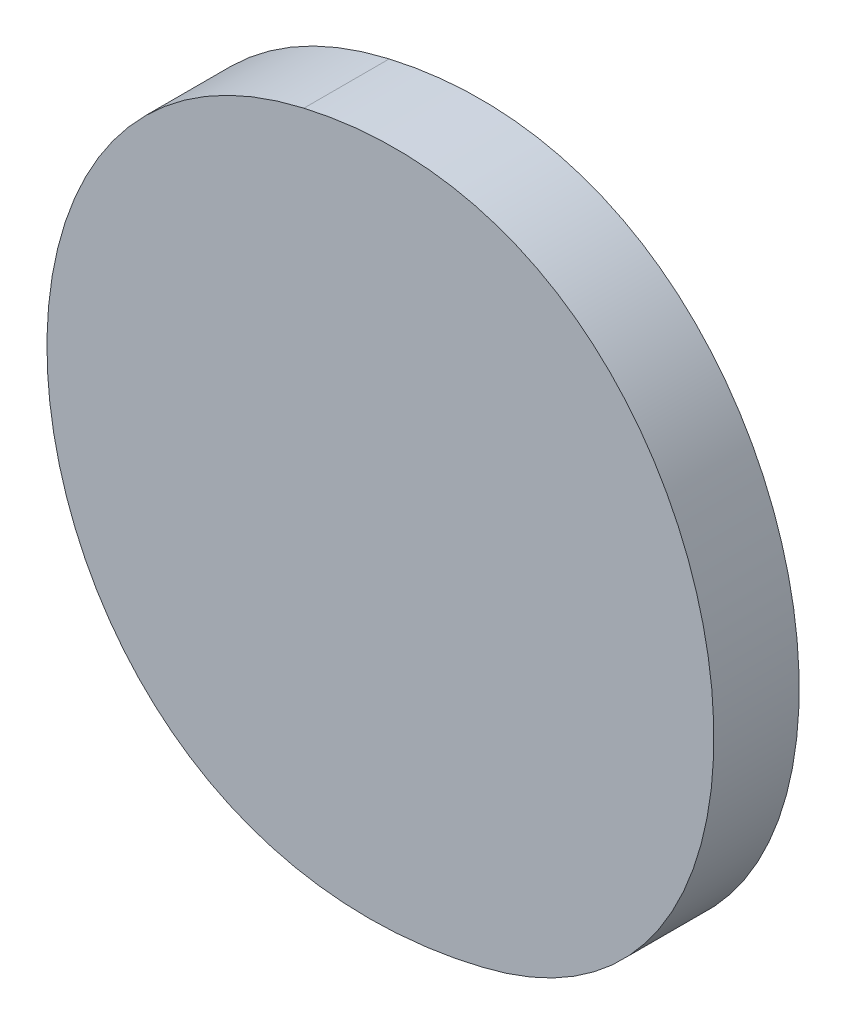
ISO-10303-21;
HEADER;
FILE_DESCRIPTION(('STEP AP214'),'2;1');
FILE_NAME('part.step','',(''),(''),'','','');
FILE_SCHEMA(('AUTOMOTIVE_DESIGN { 1 0 10303 214 1 1 1 1 }'));
ENDSEC;
DATA;
#1=APPLICATION_CONTEXT('core data for automotive mechanical design processes');
#2=APPLICATION_PROTOCOL_DEFINITION('international standard','automotive_design',2000,#1);
#3=PRODUCT_CONTEXT('',#1,'mechanical');
#4=PRODUCT('Part','Part','',(#3));
#5=PRODUCT_RELATED_PRODUCT_CATEGORY('part','',(#4));
#6=PRODUCT_DEFINITION_FORMATION('','',#4);
#7=PRODUCT_DEFINITION_CONTEXT('part definition',#1,'design');
#8=PRODUCT_DEFINITION('design','',#6,#7);
#9=PRODUCT_DEFINITION_SHAPE('','',#8);
#10=(LENGTH_UNIT() NAMED_UNIT(*) SI_UNIT(.MILLI.,.METRE.));
#11=(NAMED_UNIT(*) PLANE_ANGLE_UNIT() SI_UNIT($,.RADIAN.));
#12=(NAMED_UNIT(*) SI_UNIT($,.STERADIAN.) SOLID_ANGLE_UNIT());
#13=UNCERTAINTY_MEASURE_WITH_UNIT(LENGTH_MEASURE(1.E-05),#10,'distance_accuracy_value','');
#14=(GEOMETRIC_REPRESENTATION_CONTEXT(3) GLOBAL_UNCERTAINTY_ASSIGNED_CONTEXT((#13)) GLOBAL_UNIT_ASSIGNED_CONTEXT((#10,
#11,#12)) REPRESENTATION_CONTEXT('',''));
#15=CARTESIAN_POINT('',(0.,0.,0.));
#16=DIRECTION('',(0.,0.,1.));
#17=DIRECTION('',(1.,0.,0.));
#18=AXIS2_PLACEMENT_3D('',#15,#16,#17);
#19=CARTESIAN_POINT('',(-1.8579795703125,-48.5325651171875,0.001));
#20=CARTESIAN_POINT('',(-1.8579795703125,-48.5325651171875,0.));
#21=CARTESIAN_POINT('',(-1.8627144140625,-48.5336528515625,0.001));
#22=CARTESIAN_POINT('',(-1.8627144140625,-48.5336528515625,0.));
#23=CARTESIAN_POINT('',(-1.8617546484375,-48.5416508984375,0.001));
#24=CARTESIAN_POINT('',(-1.8617546484375,-48.5416508984375,0.));
#25=CARTESIAN_POINT('',(-1.855900078125,-48.5402432421875,0.001));
#26=CARTESIAN_POINT('',(-1.855900078125,-48.5402432421875,0.));
#27=B_SPLINE_SURFACE_WITH_KNOTS('',3,1,((#19,#20),(#21,#22),(#23,#24),(#25,#26)),.UNSPECIFIED.,
.F.,.F.,.F.,(4,4),(2,2),(0.,0.333333333333333),(0.,1.),.UNSPECIFIED.);
#28=CARTESIAN_POINT('',(-1.8579795703125,-48.5325651171875,0.));
#29=CARTESIAN_POINT('',(-1.8627144140625,-48.5336528515625,0.));
#30=CARTESIAN_POINT('',(-1.8617546484375,-48.5416508984375,0.));
#31=CARTESIAN_POINT('',(-1.855900078125,-48.5402432421875,0.));
#32=B_SPLINE_CURVE_WITH_KNOTS('',3,(#28,#29,#30,#31),.UNSPECIFIED.,.F.,.F.,(4,4),(0.,
0.333333333333333),.UNSPECIFIED.);
#33=CARTESIAN_POINT('',(-1.8579795703125,-48.5325651171875,0.));
#34=VERTEX_POINT('',#33);
#35=CARTESIAN_POINT('',(-1.855900078125,-48.5402432421875,0.));
#36=VERTEX_POINT('',#35);
#37=EDGE_CURVE('E11',#34,#36,#32,.T.);
#38=DIRECTION('',(0.,0.,-1.));
#39=VECTOR('',#38,1.);
#40=CARTESIAN_POINT('',(-1.855900078125,-48.5402432421875,0.001));
#41=LINE('',#40,#39);
#42=CARTESIAN_POINT('',(-1.855900078125,-48.5402432421875,0.001));
#43=VERTEX_POINT('',#42);
#44=EDGE_CURVE('E28',#43,#36,#41,.T.);
#45=CARTESIAN_POINT('',(-1.8579795703125,-48.5325651171875,0.001));
#46=CARTESIAN_POINT('',(-1.8627144140625,-48.5336528515625,0.001));
#47=CARTESIAN_POINT('',(-1.8617546484375,-48.5416508984375,0.001));
#48=CARTESIAN_POINT('',(-1.855900078125,-48.5402432421875,0.001));
#49=B_SPLINE_CURVE_WITH_KNOTS('',3,(#45,#46,#47,#48),.UNSPECIFIED.,.F.,.F.,(4,4),(0.,
0.333333333333333),.UNSPECIFIED.);
#50=CARTESIAN_POINT('',(-1.8579795703125,-48.5325651171875,0.001));
#51=VERTEX_POINT('',#50);
#52=EDGE_CURVE('E51',#51,#43,#49,.T.);
#53=DIRECTION('',(0.,0.,-1.));
#54=VECTOR('',#53,1.);
#55=CARTESIAN_POINT('',(-1.8579795703125,-48.5325651171875,0.001));
#56=LINE('',#55,#54);
#57=EDGE_CURVE('E40',#51,#34,#56,.T.);
#58=ORIENTED_EDGE('',*,*,#37,.T.);
#59=ORIENTED_EDGE('',*,*,#44,.F.);
#60=ORIENTED_EDGE('',*,*,#52,.F.);
#61=ORIENTED_EDGE('',*,*,#57,.T.);
#62=EDGE_LOOP('',(#58,#59,#60,#61));
#63=FACE_BOUND('',#62,.T.);
#64=ADVANCED_FACE('F17',(#63),#27,.F.);
#65=CARTESIAN_POINT('',(-1.855900078125,-48.5402432421875,0.001));
#66=CARTESIAN_POINT('',(-1.855900078125,-48.5402432421875,0.));
#67=CARTESIAN_POINT('',(-1.851421171875,-48.5391875,0.001));
#68=CARTESIAN_POINT('',(-1.851421171875,-48.5391875,0.));
#69=CARTESIAN_POINT('',(-1.852700859375,-48.5313494140625,0.001));
#70=CARTESIAN_POINT('',(-1.852700859375,-48.5313494140625,0.));
#71=CARTESIAN_POINT('',(-1.8579795703125,-48.5325651171875,0.001));
#72=CARTESIAN_POINT('',(-1.8579795703125,-48.5325651171875,0.));
#73=B_SPLINE_SURFACE_WITH_KNOTS('',3,1,((#65,#66),(#67,#68),(#69,#70),(#71,#72)),.UNSPECIFIED.,
.F.,.F.,.F.,(4,4),(2,2),(0.333333333333333,1.),(0.,1.),.UNSPECIFIED.);
#74=CARTESIAN_POINT('',(-1.855900078125,-48.5402432421875,0.));
#75=CARTESIAN_POINT('',(-1.851421171875,-48.5391875,0.));
#76=CARTESIAN_POINT('',(-1.852700859375,-48.5313494140625,0.));
#77=CARTESIAN_POINT('',(-1.8579795703125,-48.5325651171875,0.));
#78=B_SPLINE_CURVE_WITH_KNOTS('',3,(#74,#75,#76,#77),.UNSPECIFIED.,.F.,.F.,(4,4),
(0.333333333333333,1.),.UNSPECIFIED.);
#79=EDGE_CURVE('E50',#36,#34,#78,.T.);
#80=CARTESIAN_POINT('',(-1.855900078125,-48.5402432421875,0.001));
#81=CARTESIAN_POINT('',(-1.851421171875,-48.5391875,0.001));
#82=CARTESIAN_POINT('',(-1.852700859375,-48.5313494140625,0.001));
#83=CARTESIAN_POINT('',(-1.8579795703125,-48.5325651171875,0.001));
#84=B_SPLINE_CURVE_WITH_KNOTS('',3,(#80,#81,#82,#83),.UNSPECIFIED.,.F.,.F.,(4,4),
(0.333333333333333,1.),.UNSPECIFIED.);
#85=EDGE_CURVE('E48',#43,#51,#84,.T.);
#86=ORIENTED_EDGE('',*,*,#79,.T.);
#87=ORIENTED_EDGE('',*,*,#57,.F.);
#88=ORIENTED_EDGE('',*,*,#85,.F.);
#89=ORIENTED_EDGE('',*,*,#44,.T.);
#90=EDGE_LOOP('',(#86,#87,#88,#89));
#91=FACE_BOUND('',#90,.T.);
#92=ADVANCED_FACE('F46',(#91),#73,.F.);
#93=CARTESIAN_POINT('',(0.,0.,0.001));
#94=DIRECTION('',(0.,0.,1.));
#95=DIRECTION('',(1.,0.,0.));
#96=AXIS2_PLACEMENT_3D('',#93,#94,#95);
#97=PLANE('',#96);
#98=ORIENTED_EDGE('',*,*,#52,.T.);
#99=ORIENTED_EDGE('',*,*,#85,.T.);
#100=EDGE_LOOP('',(#98,#99));
#101=FACE_BOUND('',#100,.T.);
#102=ADVANCED_FACE('F55',(#101),#97,.T.);
#103=CARTESIAN_POINT('',(0.,0.,0.));
#104=DIRECTION('',(0.,0.,1.));
#105=DIRECTION('',(1.,0.,0.));
#106=AXIS2_PLACEMENT_3D('',#103,#104,#105);
#107=PLANE('',#106);
#108=ORIENTED_EDGE('',*,*,#37,.F.);
#109=ORIENTED_EDGE('',*,*,#79,.F.);
#110=EDGE_LOOP('',(#108,#109));
#111=FACE_BOUND('',#110,.T.);
#112=ADVANCED_FACE('F74',(#111),#107,.F.);
#113=CLOSED_SHELL('',(#64,#92,#102,#112));
#114=MANIFOLD_SOLID_BREP('B1',#113);
#115=ADVANCED_BREP_SHAPE_REPRESENTATION('',(#18,#114),#14);
#116=SHAPE_DEFINITION_REPRESENTATION(#9,#115);
ENDSEC;
END-ISO-10303-21;
